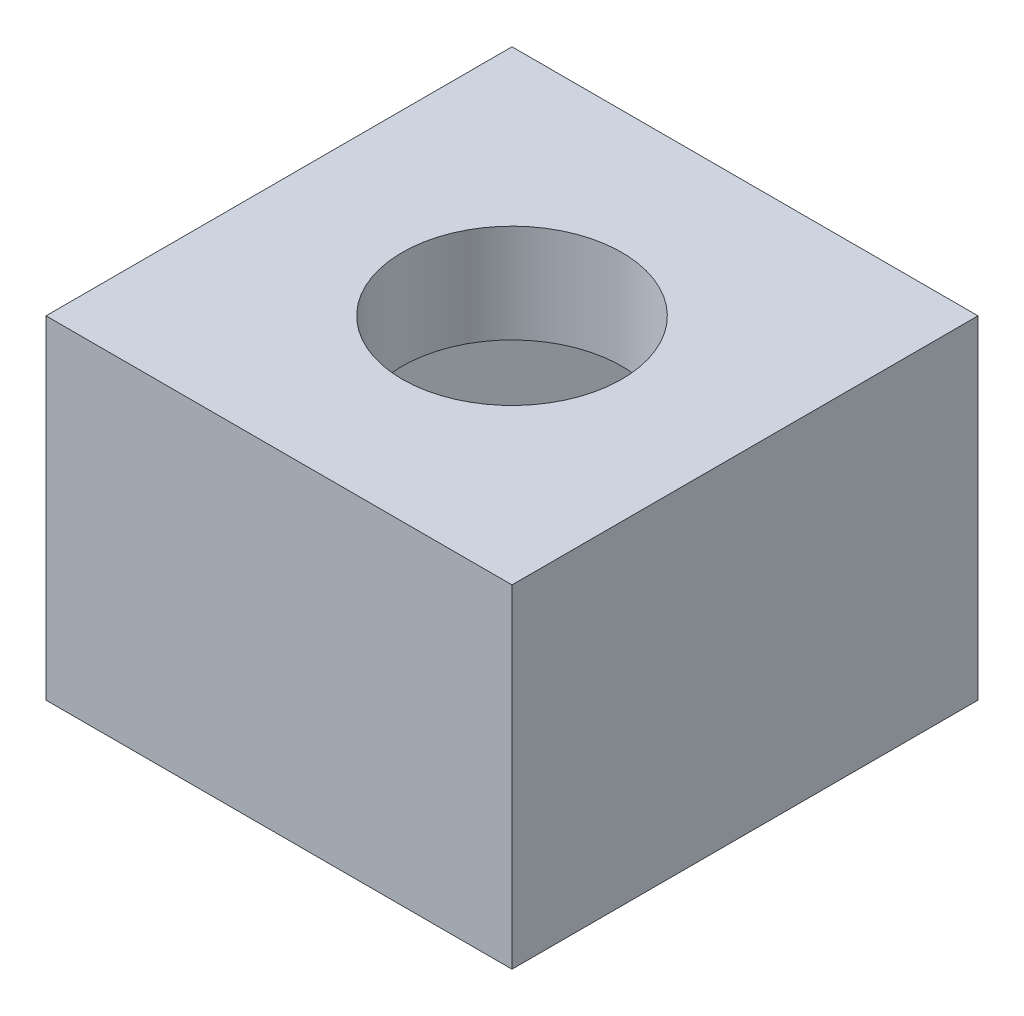
ISO-10303-21;
HEADER;
FILE_DESCRIPTION(('STEP AP214'),'2;1');
FILE_NAME('part.step','',(''),(''),'','','');
FILE_SCHEMA(('AUTOMOTIVE_DESIGN { 1 0 10303 214 1 1 1 1 }'));
ENDSEC;
DATA;
#1=APPLICATION_CONTEXT('core data for automotive mechanical design processes');
#2=APPLICATION_PROTOCOL_DEFINITION('international standard','automotive_design',2000,#1);
#3=PRODUCT_CONTEXT('',#1,'mechanical');
#4=PRODUCT('Part','Part','',(#3));
#5=PRODUCT_RELATED_PRODUCT_CATEGORY('part','',(#4));
#6=PRODUCT_DEFINITION_FORMATION('','',#4);
#7=PRODUCT_DEFINITION_CONTEXT('part definition',#1,'design');
#8=PRODUCT_DEFINITION('design','',#6,#7);
#9=PRODUCT_DEFINITION_SHAPE('','',#8);
#10=(LENGTH_UNIT() NAMED_UNIT(*) SI_UNIT(.MILLI.,.METRE.));
#11=(NAMED_UNIT(*) PLANE_ANGLE_UNIT() SI_UNIT($,.RADIAN.));
#12=(NAMED_UNIT(*) SI_UNIT($,.STERADIAN.) SOLID_ANGLE_UNIT());
#13=UNCERTAINTY_MEASURE_WITH_UNIT(LENGTH_MEASURE(1.E-05),#10,'distance_accuracy_value','');
#14=(GEOMETRIC_REPRESENTATION_CONTEXT(3) GLOBAL_UNCERTAINTY_ASSIGNED_CONTEXT((#13)) GLOBAL_UNIT_ASSIGNED_CONTEXT((#10,
#11,#12)) REPRESENTATION_CONTEXT('',''));
#15=CARTESIAN_POINT('',(0.,0.,0.));
#16=DIRECTION('',(0.,0.,1.));
#17=DIRECTION('',(1.,0.,0.));
#18=AXIS2_PLACEMENT_3D('',#15,#16,#17);
#19=CARTESIAN_POINT('',(-4.17779660960651,5.,-1.37171277354378));
#20=DIRECTION('',(1.,0.,0.));
#21=DIRECTION('',(0.,0.,-1.));
#22=AXIS2_PLACEMENT_3D('',#19,#20,#21);
#23=PLANE('',#22);
#24=DIRECTION('',(0.,0.,1.));
#25=VECTOR('',#24,1.);
#26=CARTESIAN_POINT('',(-4.17779660960651,0.,-1.37171277354378));
#27=LINE('',#26,#25);
#28=CARTESIAN_POINT('',(-4.17779660960651,0.,-1.37171277354378));
#29=VERTEX_POINT('',#28);
#30=CARTESIAN_POINT('',(-4.17779660960651,0.,5.62828722645622));
#31=VERTEX_POINT('',#30);
#32=EDGE_CURVE('E162',#29,#31,#27,.T.);
#33=ORIENTED_EDGE('',*,*,#32,.T.);
#34=DIRECTION('',(0.,-1.,0.));
#35=VECTOR('',#34,1.);
#36=CARTESIAN_POINT('',(-4.17779660960651,5.,5.62828722645622));
#37=LINE('',#36,#35);
#38=CARTESIAN_POINT('',(-4.17779660960651,5.,5.62828722645622));
#39=VERTEX_POINT('',#38);
#40=EDGE_CURVE('E11',#39,#31,#37,.T.);
#41=ORIENTED_EDGE('',*,*,#40,.F.);
#42=DIRECTION('',(0.,0.,1.));
#43=VECTOR('',#42,1.);
#44=CARTESIAN_POINT('',(-4.17779660960651,5.,-1.37171277354378));
#45=LINE('',#44,#43);
#46=CARTESIAN_POINT('',(-4.17779660960651,5.,-1.37171277354378));
#47=VERTEX_POINT('',#46);
#48=EDGE_CURVE('E171',#47,#39,#45,.T.);
#49=ORIENTED_EDGE('',*,*,#48,.F.);
#50=DIRECTION('',(0.,-1.,0.));
#51=VECTOR('',#50,1.);
#52=CARTESIAN_POINT('',(-4.17779660960651,5.,-1.37171277354378));
#53=LINE('',#52,#51);
#54=EDGE_CURVE('E181',#47,#29,#53,.T.);
#55=ORIENTED_EDGE('',*,*,#54,.T.);
#56=EDGE_LOOP('',(#33,#41,#49,#55));
#57=FACE_BOUND('',#56,.T.);
#58=ADVANCED_FACE('F35',(#57),#23,.F.);
#59=CARTESIAN_POINT('',(-4.17779660960651,5.,5.62828722645622));
#60=DIRECTION('',(0.,0.,-1.));
#61=DIRECTION('',(-1.,0.,0.));
#62=AXIS2_PLACEMENT_3D('',#59,#60,#61);
#63=PLANE('',#62);
#64=DIRECTION('',(1.,0.,0.));
#65=VECTOR('',#64,1.);
#66=CARTESIAN_POINT('',(-4.17779660960651,0.,5.62828722645622));
#67=LINE('',#66,#65);
#68=CARTESIAN_POINT('',(2.82220339039349,0.,5.62828722645622));
#69=VERTEX_POINT('',#68);
#70=EDGE_CURVE('E184',#31,#69,#67,.T.);
#71=ORIENTED_EDGE('',*,*,#70,.T.);
#72=DIRECTION('',(0.,-1.,0.));
#73=VECTOR('',#72,1.);
#74=CARTESIAN_POINT('',(2.82220339039349,5.,5.62828722645622));
#75=LINE('',#74,#73);
#76=CARTESIAN_POINT('',(2.82220339039349,5.,5.62828722645622));
#77=VERTEX_POINT('',#76);
#78=EDGE_CURVE('E42',#77,#69,#75,.T.);
#79=ORIENTED_EDGE('',*,*,#78,.F.);
#80=DIRECTION('',(1.,0.,0.));
#81=VECTOR('',#80,1.);
#82=CARTESIAN_POINT('',(-4.17779660960651,5.,5.62828722645622));
#83=LINE('',#82,#81);
#84=EDGE_CURVE('E174',#39,#77,#83,.T.);
#85=ORIENTED_EDGE('',*,*,#84,.F.);
#86=ORIENTED_EDGE('',*,*,#40,.T.);
#87=EDGE_LOOP('',(#71,#79,#85,#86));
#88=FACE_BOUND('',#87,.T.);
#89=ADVANCED_FACE('F215',(#88),#63,.F.);
#90=CARTESIAN_POINT('',(2.82220339039349,5.,-1.37171277354378));
#91=DIRECTION('',(-1.,0.,0.));
#92=DIRECTION('',(0.,0.,1.));
#93=AXIS2_PLACEMENT_3D('',#90,#91,#92);
#94=PLANE('',#93);
#95=DIRECTION('',(0.,0.,-1.));
#96=VECTOR('',#95,1.);
#97=CARTESIAN_POINT('',(2.82220339039349,0.,-1.37171277354378));
#98=LINE('',#97,#96);
#99=CARTESIAN_POINT('',(2.82220339039349,0.,-1.37171277354378));
#100=VERTEX_POINT('',#99);
#101=EDGE_CURVE('E186',#69,#100,#98,.T.);
#102=ORIENTED_EDGE('',*,*,#101,.T.);
#103=DIRECTION('',(0.,-1.,0.));
#104=VECTOR('',#103,1.);
#105=CARTESIAN_POINT('',(2.82220339039349,5.,-1.37171277354378));
#106=LINE('',#105,#104);
#107=CARTESIAN_POINT('',(2.82220339039349,5.,-1.37171277354378));
#108=VERTEX_POINT('',#107);
#109=EDGE_CURVE('E191',#108,#100,#106,.T.);
#110=ORIENTED_EDGE('',*,*,#109,.F.);
#111=DIRECTION('',(0.,0.,-1.));
#112=VECTOR('',#111,1.);
#113=CARTESIAN_POINT('',(2.82220339039349,5.,-1.37171277354378));
#114=LINE('',#113,#112);
#115=EDGE_CURVE('E177',#77,#108,#114,.T.);
#116=ORIENTED_EDGE('',*,*,#115,.F.);
#117=ORIENTED_EDGE('',*,*,#78,.T.);
#118=EDGE_LOOP('',(#102,#110,#116,#117));
#119=FACE_BOUND('',#118,.T.);
#120=ADVANCED_FACE('F198',(#119),#94,.F.);
#121=CARTESIAN_POINT('',(-4.17779660960651,5.,-1.37171277354378));
#122=DIRECTION('',(0.,0.,1.));
#123=DIRECTION('',(1.,0.,0.));
#124=AXIS2_PLACEMENT_3D('',#121,#122,#123);
#125=PLANE('',#124);
#126=DIRECTION('',(-1.,0.,0.));
#127=VECTOR('',#126,1.);
#128=CARTESIAN_POINT('',(-4.17779660960651,0.,-1.37171277354378));
#129=LINE('',#128,#127);
#130=EDGE_CURVE('E175',#100,#29,#129,.T.);
#131=ORIENTED_EDGE('',*,*,#130,.T.);
#132=ORIENTED_EDGE('',*,*,#54,.F.);
#133=DIRECTION('',(-1.,0.,0.));
#134=VECTOR('',#133,1.);
#135=CARTESIAN_POINT('',(-4.17779660960651,5.,-1.37171277354378));
#136=LINE('',#135,#134);
#137=EDGE_CURVE('E179',#108,#47,#136,.T.);
#138=ORIENTED_EDGE('',*,*,#137,.F.);
#139=ORIENTED_EDGE('',*,*,#109,.T.);
#140=EDGE_LOOP('',(#131,#132,#138,#139));
#141=FACE_BOUND('',#140,.T.);
#142=ADVANCED_FACE('F207',(#141),#125,.F.);
#143=CARTESIAN_POINT('',(0.,5.,0.));
#144=DIRECTION('',(0.,1.,0.));
#145=DIRECTION('',(0.,0.,1.));
#146=AXIS2_PLACEMENT_3D('',#143,#144,#145);
#147=PLANE('',#146);
#148=ORIENTED_EDGE('',*,*,#48,.T.);
#149=ORIENTED_EDGE('',*,*,#84,.T.);
#150=ORIENTED_EDGE('',*,*,#115,.T.);
#151=ORIENTED_EDGE('',*,*,#137,.T.);
#152=EDGE_LOOP('',(#148,#149,#150,#151));
#153=FACE_BOUND('',#152,.T.);
#154=CARTESIAN_POINT('',(-0.677796609606513,5.,2.12828722645622));
#155=DIRECTION('',(0.,1.,0.));
#156=DIRECTION('',(0.,0.,1.));
#157=AXIS2_PLACEMENT_3D('',#154,#155,#156);
#158=CIRCLE('',#157,1.65);
#159=CARTESIAN_POINT('',(-0.677796609606513,5.,3.77828722645622));
#160=VERTEX_POINT('',#159);
#161=EDGE_CURVE('E145',#160,#160,#158,.T.);
#162=ORIENTED_EDGE('',*,*,#161,.F.);
#163=EDGE_LOOP('',(#162));
#164=FACE_BOUND('',#163,.T.);
#165=ADVANCED_FACE('F213',(#153,#164),#147,.T.);
#166=CARTESIAN_POINT('',(0.,0.,0.));
#167=DIRECTION('',(0.,1.,0.));
#168=DIRECTION('',(0.,0.,1.));
#169=AXIS2_PLACEMENT_3D('',#166,#167,#168);
#170=PLANE('',#169);
#171=ORIENTED_EDGE('',*,*,#32,.F.);
#172=ORIENTED_EDGE('',*,*,#130,.F.);
#173=ORIENTED_EDGE('',*,*,#101,.F.);
#174=ORIENTED_EDGE('',*,*,#70,.F.);
#175=EDGE_LOOP('',(#171,#172,#173,#174));
#176=FACE_BOUND('',#175,.T.);
#177=ADVANCED_FACE('F204',(#176),#170,.F.);
#178=CARTESIAN_POINT('',(-0.677796609606513,3.52,2.12828722645622));
#179=DIRECTION('',(0.,1.,0.));
#180=DIRECTION('',(0.,0.,1.));
#181=AXIS2_PLACEMENT_3D('',#178,#179,#180);
#182=CYLINDRICAL_SURFACE('',#181,1.65);
#183=CARTESIAN_POINT('',(-0.677796609606513,3.52,2.12828722645622));
#184=DIRECTION('',(0.,1.,0.));
#185=DIRECTION('',(0.,0.,1.));
#186=AXIS2_PLACEMENT_3D('',#183,#184,#185);
#187=CIRCLE('',#186,1.65);
#188=CARTESIAN_POINT('',(-0.677796609606513,3.52,3.77828722645622));
#189=VERTEX_POINT('',#188);
#190=EDGE_CURVE('E130',#189,#189,#187,.T.);
#191=ORIENTED_EDGE('',*,*,#190,.F.);
#192=EDGE_LOOP('',(#191));
#193=FACE_BOUND('',#192,.T.);
#194=ORIENTED_EDGE('',*,*,#161,.T.);
#195=EDGE_LOOP('',(#194));
#196=FACE_BOUND('',#195,.T.);
#197=ADVANCED_FACE('F227',(#193,#196),#182,.F.);
#198=CARTESIAN_POINT('',(0.,3.52,0.));
#199=DIRECTION('',(0.,1.,0.));
#200=DIRECTION('',(0.,0.,1.));
#201=AXIS2_PLACEMENT_3D('',#198,#199,#200);
#202=PLANE('',#201);
#203=ORIENTED_EDGE('',*,*,#190,.T.);
#204=EDGE_LOOP('',(#203));
#205=FACE_BOUND('',#204,.T.);
#206=DIRECTION('',(-0.965925826289068,0.,-0.258819045102521));
#207=VECTOR('',#206,1.);
#208=CARTESIAN_POINT('',(0.1730996606391,3.52,-0.646016728278052));
#209=LINE('',#208,#207);
#210=CARTESIAN_POINT('',(1.69004347508389,3.52,-0.239552858234186));
#211=VERTEX_POINT('',#210);
#212=CARTESIAN_POINT('',(-1.5444862327023,3.52,-1.10624248132997));
#213=VERTEX_POINT('',#212);
#214=EDGE_CURVE('E126',#211,#213,#209,.T.);
#215=ORIENTED_EDGE('',*,*,#214,.F.);
#216=DIRECTION('',(-0.258819045102521,0.,-0.965925826289068));
#217=VECTOR('',#216,1.);
#218=CARTESIAN_POINT('',(1.63672024356188,3.52,-0.438557867498077));
#219=LINE('',#218,#217);
#220=CARTESIAN_POINT('',(2.55673309817968,3.52,2.994976849552));
#221=VERTEX_POINT('',#220);
#222=EDGE_CURVE('E49',#221,#211,#219,.T.);
#223=ORIENTED_EDGE('',*,*,#222,.F.);
#224=DIRECTION('',(0.707106781186548,0.,-0.707106781186548));
#225=VECTOR('',#224,1.);
#226=CARTESIAN_POINT('',(2.77585497386584,3.52,2.77585497386584));
#227=LINE('',#226,#225);
#228=CARTESIAN_POINT('',(0.18889301348927,3.52,5.36281693424241));
#229=VERTEX_POINT('',#228);
#230=EDGE_CURVE('E57',#229,#221,#227,.T.);
#231=ORIENTED_EDGE('',*,*,#230,.F.);
#232=DIRECTION('',(0.965925826289068,0.,0.258819045102521));
#233=VECTOR('',#232,1.);
#234=CARTESIAN_POINT('',(-1.32805080095552,3.52,4.95635306419854));
#235=LINE('',#234,#233);
#236=CARTESIAN_POINT('',(-3.04563669429692,3.52,4.49612731114663));
#237=VERTEX_POINT('',#236);
#238=EDGE_CURVE('E137',#237,#229,#235,.T.);
#239=ORIENTED_EDGE('',*,*,#238,.F.);
#240=DIRECTION('',(0.258819045102521,0.,0.965925826289068));
#241=VECTOR('',#240,1.);
#242=CARTESIAN_POINT('',(-3.96564954891471,3.52,1.06259259409654));
#243=LINE('',#242,#241);
#244=CARTESIAN_POINT('',(-3.9123263173927,3.52,1.26159760336044));
#245=VERTEX_POINT('',#244);
#246=EDGE_CURVE('E135',#245,#237,#243,.T.);
#247=ORIENTED_EDGE('',*,*,#246,.F.);
#248=DIRECTION('',(-0.707106781186547,0.,0.707106781186548));
#249=VECTOR('',#248,1.);
#250=CARTESIAN_POINT('',(-1.32536435701613,3.52,-1.32536435701613));
#251=LINE('',#250,#249);
#252=EDGE_CURVE('E115',#213,#245,#251,.T.);
#253=ORIENTED_EDGE('',*,*,#252,.F.);
#254=EDGE_LOOP('',(#215,#223,#231,#239,#247,#253));
#255=FACE_BOUND('',#254,.T.);
#256=ADVANCED_FACE('F133',(#205,#255),#202,.F.);
#257=CARTESIAN_POINT('',(0.,1.,0.));
#258=DIRECTION('',(0.,1.,0.));
#259=DIRECTION('',(0.,0.,1.));
#260=AXIS2_PLACEMENT_3D('',#257,#258,#259);
#261=PLANE('',#260);
#262=DIRECTION('',(-0.965925826289068,0.,-0.258819045102521));
#263=VECTOR('',#262,1.);
#264=CARTESIAN_POINT('',(1.69004347508389,1.,-0.239552858234186));
#265=LINE('',#264,#263);
#266=CARTESIAN_POINT('',(1.69004347508389,1.,-0.239552858234186));
#267=VERTEX_POINT('',#266);
#268=CARTESIAN_POINT('',(-1.5444862327023,1.,-1.10624248132997));
#269=VERTEX_POINT('',#268);
#270=EDGE_CURVE('E144',#267,#269,#265,.T.);
#271=ORIENTED_EDGE('',*,*,#270,.T.);
#272=DIRECTION('',(-0.707106781186547,0.,0.707106781186548));
#273=VECTOR('',#272,1.);
#274=CARTESIAN_POINT('',(-1.5444862327023,1.,-1.10624248132997));
#275=LINE('',#274,#273);
#276=CARTESIAN_POINT('',(-3.9123263173927,1.,1.26159760336044));
#277=VERTEX_POINT('',#276);
#278=EDGE_CURVE('E118',#269,#277,#275,.T.);
#279=ORIENTED_EDGE('',*,*,#278,.T.);
#280=DIRECTION('',(0.258819045102521,0.,0.965925826289068));
#281=VECTOR('',#280,1.);
#282=CARTESIAN_POINT('',(-3.9123263173927,1.,1.26159760336044));
#283=LINE('',#282,#281);
#284=CARTESIAN_POINT('',(-3.04563669429692,1.,4.49612731114663));
#285=VERTEX_POINT('',#284);
#286=EDGE_CURVE('E150',#277,#285,#283,.T.);
#287=ORIENTED_EDGE('',*,*,#286,.T.);
#288=DIRECTION('',(0.965925826289068,0.,0.258819045102521));
#289=VECTOR('',#288,1.);
#290=CARTESIAN_POINT('',(-3.04563669429692,1.,4.49612731114663));
#291=LINE('',#290,#289);
#292=CARTESIAN_POINT('',(0.18889301348927,1.,5.36281693424241));
#293=VERTEX_POINT('',#292);
#294=EDGE_CURVE('E153',#285,#293,#291,.T.);
#295=ORIENTED_EDGE('',*,*,#294,.T.);
#296=DIRECTION('',(0.707106781186547,0.,-0.707106781186548));
#297=VECTOR('',#296,1.);
#298=CARTESIAN_POINT('',(0.18889301348927,1.,5.36281693424241));
#299=LINE('',#298,#297);
#300=CARTESIAN_POINT('',(2.55673309817968,1.,2.994976849552));
#301=VERTEX_POINT('',#300);
#302=EDGE_CURVE('E156',#293,#301,#299,.T.);
#303=ORIENTED_EDGE('',*,*,#302,.T.);
#304=DIRECTION('',(-0.258819045102521,0.,-0.965925826289068));
#305=VECTOR('',#304,1.);
#306=CARTESIAN_POINT('',(2.55673309817968,1.,2.994976849552));
#307=LINE('',#306,#305);
#308=EDGE_CURVE('E123',#301,#267,#307,.T.);
#309=ORIENTED_EDGE('',*,*,#308,.T.);
#310=EDGE_LOOP('',(#271,#279,#287,#295,#303,#309));
#311=FACE_BOUND('',#310,.T.);
#312=ADVANCED_FACE('F236',(#311),#261,.T.);
#313=CARTESIAN_POINT('',(-1.5444862327023,1.,-1.10624248132997));
#314=DIRECTION('',(-0.707106781186548,0.,-0.707106781186547));
#315=DIRECTION('',(-0.707106781186547,0.,0.707106781186548));
#316=AXIS2_PLACEMENT_3D('',#313,#314,#315);
#317=PLANE('',#316);
#318=ORIENTED_EDGE('',*,*,#252,.T.);
#319=DIRECTION('',(0.,1.,0.));
#320=VECTOR('',#319,1.);
#321=CARTESIAN_POINT('',(-3.9123263173927,1.,1.26159760336044));
#322=LINE('',#321,#320);
#323=EDGE_CURVE('E122',#277,#245,#322,.T.);
#324=ORIENTED_EDGE('',*,*,#323,.F.);
#325=ORIENTED_EDGE('',*,*,#278,.F.);
#326=DIRECTION('',(0.,1.,0.));
#327=VECTOR('',#326,1.);
#328=CARTESIAN_POINT('',(-1.5444862327023,1.,-1.10624248132997));
#329=LINE('',#328,#327);
#330=EDGE_CURVE('E111',#269,#213,#329,.T.);
#331=ORIENTED_EDGE('',*,*,#330,.T.);
#332=EDGE_LOOP('',(#318,#324,#325,#331));
#333=FACE_BOUND('',#332,.T.);
#334=ADVANCED_FACE('F113',(#333),#317,.F.);
#335=CARTESIAN_POINT('',(-3.9123263173927,1.,1.26159760336044));
#336=DIRECTION('',(-0.965925826289068,0.,0.258819045102521));
#337=DIRECTION('',(0.258819045102521,0.,0.965925826289068));
#338=AXIS2_PLACEMENT_3D('',#335,#336,#337);
#339=PLANE('',#338);
#340=ORIENTED_EDGE('',*,*,#246,.T.);
#341=DIRECTION('',(0.,1.,0.));
#342=VECTOR('',#341,1.);
#343=CARTESIAN_POINT('',(-3.04563669429692,1.,4.49612731114663));
#344=LINE('',#343,#342);
#345=EDGE_CURVE('E167',#285,#237,#344,.T.);
#346=ORIENTED_EDGE('',*,*,#345,.F.);
#347=ORIENTED_EDGE('',*,*,#286,.F.);
#348=ORIENTED_EDGE('',*,*,#323,.T.);
#349=EDGE_LOOP('',(#340,#346,#347,#348));
#350=FACE_BOUND('',#349,.T.);
#351=ADVANCED_FACE('F235',(#350),#339,.F.);
#352=CARTESIAN_POINT('',(-3.04563669429692,1.,4.49612731114663));
#353=DIRECTION('',(-0.258819045102521,0.,0.965925826289068));
#354=DIRECTION('',(0.965925826289068,0.,0.258819045102521));
#355=AXIS2_PLACEMENT_3D('',#352,#353,#354);
#356=PLANE('',#355);
#357=ORIENTED_EDGE('',*,*,#238,.T.);
#358=DIRECTION('',(0.,1.,0.));
#359=VECTOR('',#358,1.);
#360=CARTESIAN_POINT('',(0.18889301348927,1.,5.36281693424241));
#361=LINE('',#360,#359);
#362=EDGE_CURVE('E165',#293,#229,#361,.T.);
#363=ORIENTED_EDGE('',*,*,#362,.F.);
#364=ORIENTED_EDGE('',*,*,#294,.F.);
#365=ORIENTED_EDGE('',*,*,#345,.T.);
#366=EDGE_LOOP('',(#357,#363,#364,#365));
#367=FACE_BOUND('',#366,.T.);
#368=ADVANCED_FACE('F239',(#367),#356,.F.);
#369=CARTESIAN_POINT('',(0.18889301348927,1.,5.36281693424241));
#370=DIRECTION('',(0.707106781186548,0.,0.707106781186547));
#371=DIRECTION('',(0.707106781186547,0.,-0.707106781186548));
#372=AXIS2_PLACEMENT_3D('',#369,#370,#371);
#373=PLANE('',#372);
#374=ORIENTED_EDGE('',*,*,#230,.T.);
#375=DIRECTION('',(0.,1.,0.));
#376=VECTOR('',#375,1.);
#377=CARTESIAN_POINT('',(2.55673309817968,1.,2.994976849552));
#378=LINE('',#377,#376);
#379=EDGE_CURVE('E163',#301,#221,#378,.T.);
#380=ORIENTED_EDGE('',*,*,#379,.F.);
#381=ORIENTED_EDGE('',*,*,#302,.F.);
#382=ORIENTED_EDGE('',*,*,#362,.T.);
#383=EDGE_LOOP('',(#374,#380,#381,#382));
#384=FACE_BOUND('',#383,.T.);
#385=ADVANCED_FACE('F243',(#384),#373,.F.);
#386=CARTESIAN_POINT('',(2.55673309817968,1.,2.994976849552));
#387=DIRECTION('',(0.965925826289068,0.,-0.258819045102521));
#388=DIRECTION('',(-0.258819045102521,0.,-0.965925826289068));
#389=AXIS2_PLACEMENT_3D('',#386,#387,#388);
#390=PLANE('',#389);
#391=ORIENTED_EDGE('',*,*,#222,.T.);
#392=DIRECTION('',(0.,1.,0.));
#393=VECTOR('',#392,1.);
#394=CARTESIAN_POINT('',(1.69004347508389,1.,-0.239552858234186));
#395=LINE('',#394,#393);
#396=EDGE_CURVE('E128',#267,#211,#395,.T.);
#397=ORIENTED_EDGE('',*,*,#396,.F.);
#398=ORIENTED_EDGE('',*,*,#308,.F.);
#399=ORIENTED_EDGE('',*,*,#379,.T.);
#400=EDGE_LOOP('',(#391,#397,#398,#399));
#401=FACE_BOUND('',#400,.T.);
#402=ADVANCED_FACE('F232',(#401),#390,.F.);
#403=CARTESIAN_POINT('',(1.69004347508389,1.,-0.239552858234186));
#404=DIRECTION('',(0.258819045102521,0.,-0.965925826289068));
#405=DIRECTION('',(-0.965925826289068,0.,-0.258819045102521));
#406=AXIS2_PLACEMENT_3D('',#403,#404,#405);
#407=PLANE('',#406);
#408=ORIENTED_EDGE('',*,*,#214,.T.);
#409=ORIENTED_EDGE('',*,*,#330,.F.);
#410=ORIENTED_EDGE('',*,*,#270,.F.);
#411=ORIENTED_EDGE('',*,*,#396,.T.);
#412=EDGE_LOOP('',(#408,#409,#410,#411));
#413=FACE_BOUND('',#412,.T.);
#414=ADVANCED_FACE('F127',(#413),#407,.F.);
#415=CLOSED_SHELL('',(#58,#89,#120,#142,#165,#177,#197,#256,#312,#334,#351,#368,#385,#402,#414));
#416=MANIFOLD_SOLID_BREP('B2',#415);
#417=ADVANCED_BREP_SHAPE_REPRESENTATION('',(#18,#416),#14);
#418=SHAPE_DEFINITION_REPRESENTATION(#9,#417);
ENDSEC;
END-ISO-10303-21;
